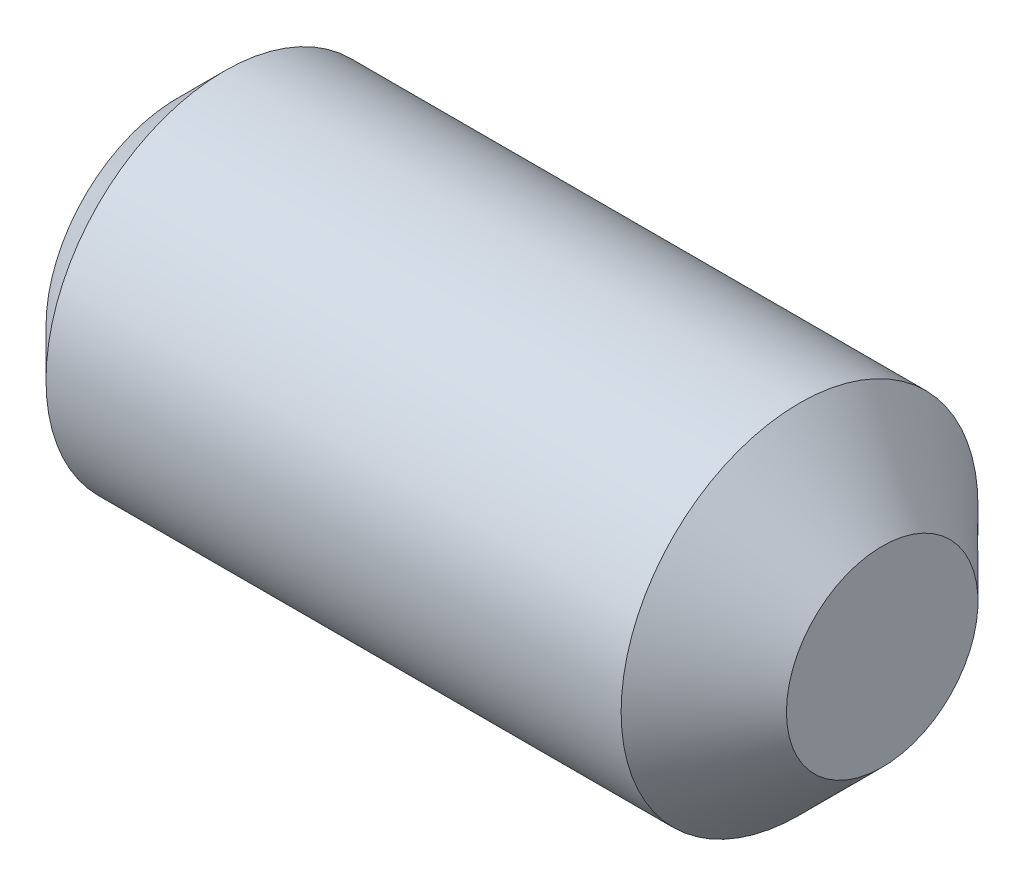
ISO-10303-21;
HEADER;
FILE_DESCRIPTION(('STEP AP214'),'2;1');
FILE_NAME('part.step','',(''),(''),'','','');
FILE_SCHEMA(('AUTOMOTIVE_DESIGN { 1 0 10303 214 1 1 1 1 }'));
ENDSEC;
DATA;
#1=APPLICATION_CONTEXT('core data for automotive mechanical design processes');
#2=APPLICATION_PROTOCOL_DEFINITION('international standard','automotive_design',2000,#1);
#3=PRODUCT_CONTEXT('',#1,'mechanical');
#4=PRODUCT('Part','Part','',(#3));
#5=PRODUCT_RELATED_PRODUCT_CATEGORY('part','',(#4));
#6=PRODUCT_DEFINITION_FORMATION('','',#4);
#7=PRODUCT_DEFINITION_CONTEXT('part definition',#1,'design');
#8=PRODUCT_DEFINITION('design','',#6,#7);
#9=PRODUCT_DEFINITION_SHAPE('','',#8);
#10=(LENGTH_UNIT() NAMED_UNIT(*) SI_UNIT(.MILLI.,.METRE.));
#11=(NAMED_UNIT(*) PLANE_ANGLE_UNIT() SI_UNIT($,.RADIAN.));
#12=(NAMED_UNIT(*) SI_UNIT($,.STERADIAN.) SOLID_ANGLE_UNIT());
#13=UNCERTAINTY_MEASURE_WITH_UNIT(LENGTH_MEASURE(1.E-05),#10,'distance_accuracy_value','');
#14=(GEOMETRIC_REPRESENTATION_CONTEXT(3) GLOBAL_UNCERTAINTY_ASSIGNED_CONTEXT((#13)) GLOBAL_UNIT_ASSIGNED_CONTEXT((#10,
#11,#12)) REPRESENTATION_CONTEXT('',''));
#15=CARTESIAN_POINT('',(0.,0.,0.));
#16=DIRECTION('',(0.,0.,1.));
#17=DIRECTION('',(1.,0.,0.));
#18=AXIS2_PLACEMENT_3D('',#15,#16,#17);
#19=CARTESIAN_POINT('',(0.,0.,0.));
#20=DIRECTION('',(-1.,0.,0.));
#21=DIRECTION('',(0.,0.,1.));
#22=AXIS2_PLACEMENT_3D('',#19,#20,#21);
#23=PLANE('',#22);
#24=CARTESIAN_POINT('',(0.,0.,0.));
#25=DIRECTION('',(-1.,0.,0.));
#26=DIRECTION('',(0.,0.,1.));
#27=AXIS2_PLACEMENT_3D('',#24,#25,#26);
#28=CIRCLE('',#27,1.78308);
#29=CARTESIAN_POINT('',(0.,0.,1.78308));
#30=VERTEX_POINT('',#29);
#31=EDGE_CURVE('E136',#30,#30,#28,.T.);
#32=ORIENTED_EDGE('',*,*,#31,.T.);
#33=EDGE_LOOP('',(#32));
#34=FACE_BOUND('',#33,.T.);
#35=DIRECTION('',(0.,0.,-1.));
#36=VECTOR('',#35,1.);
#37=CARTESIAN_POINT('',(0.,1.18999,0.687041046832968));
#38=LINE('',#37,#36);
#39=CARTESIAN_POINT('',(0.,1.18999,0.687041046832968));
#40=VERTEX_POINT('',#39);
#41=CARTESIAN_POINT('',(0.,1.18999,-0.687041046832959));
#42=VERTEX_POINT('',#41);
#43=EDGE_CURVE('E127',#40,#42,#38,.T.);
#44=ORIENTED_EDGE('',*,*,#43,.F.);
#45=DIRECTION('',(0.,-0.86602540378444,0.499999999999998));
#46=VECTOR('',#45,1.);
#47=CARTESIAN_POINT('',(0.,1.18999,0.687041046832968));
#48=LINE('',#47,#46);
#49=CARTESIAN_POINT('',(0.,0.,1.37408209366593));
#50=VERTEX_POINT('',#49);
#51=EDGE_CURVE('E49',#40,#50,#48,.T.);
#52=ORIENTED_EDGE('',*,*,#51,.T.);
#53=DIRECTION('',(0.,0.866025403784439,0.5));
#54=VECTOR('',#53,1.);
#55=CARTESIAN_POINT('',(0.,-1.18999,0.687041046832965));
#56=LINE('',#55,#54);
#57=CARTESIAN_POINT('',(0.,-1.18999,0.687041046832965));
#58=VERTEX_POINT('',#57);
#59=EDGE_CURVE('E118',#58,#50,#56,.T.);
#60=ORIENTED_EDGE('',*,*,#59,.F.);
#61=DIRECTION('',(0.,0.,-1.));
#62=VECTOR('',#61,1.);
#63=CARTESIAN_POINT('',(0.,-1.18999,0.687041046832965));
#64=LINE('',#63,#62);
#65=CARTESIAN_POINT('',(0.,-1.18999,-0.687041046832961));
#66=VERTEX_POINT('',#65);
#67=EDGE_CURVE('E121',#58,#66,#64,.T.);
#68=ORIENTED_EDGE('',*,*,#67,.T.);
#69=DIRECTION('',(0.,0.86602540378444,-0.499999999999999));
#70=VECTOR('',#69,1.);
#71=CARTESIAN_POINT('',(0.,-1.18999,-0.687041046832961));
#72=LINE('',#71,#70);
#73=CARTESIAN_POINT('',(0.,0.,-1.37408209366592));
#74=VERTEX_POINT('',#73);
#75=EDGE_CURVE('E124',#66,#74,#72,.T.);
#76=ORIENTED_EDGE('',*,*,#75,.T.);
#77=DIRECTION('',(0.,-0.866025403784439,-0.5));
#78=VECTOR('',#77,1.);
#79=CARTESIAN_POINT('',(0.,1.18999,-0.687041046832959));
#80=LINE('',#79,#78);
#81=EDGE_CURVE('E107',#42,#74,#80,.T.);
#82=ORIENTED_EDGE('',*,*,#81,.F.);
#83=EDGE_LOOP('',(#44,#52,#60,#68,#76,#82));
#84=FACE_BOUND('',#83,.T.);
#85=ADVANCED_FACE('F34',(#34,#84),#23,.T.);
#86=CARTESIAN_POINT('',(9.525,1.2954,0.));
#87=DIRECTION('',(1.,0.,0.));
#88=DIRECTION('',(0.,0.,-1.));
#89=AXIS2_PLACEMENT_3D('',#86,#87,#88);
#90=PLANE('',#89);
#91=CARTESIAN_POINT('',(9.525,0.,0.));
#92=DIRECTION('',(-1.,0.,0.));
#93=DIRECTION('',(0.,0.,1.));
#94=AXIS2_PLACEMENT_3D('',#91,#92,#93);
#95=CIRCLE('',#94,1.2954);
#96=CARTESIAN_POINT('',(9.525,0.,1.2954));
#97=VERTEX_POINT('',#96);
#98=EDGE_CURVE('E11',#97,#97,#95,.T.);
#99=ORIENTED_EDGE('',*,*,#98,.F.);
#100=EDGE_LOOP('',(#99));
#101=FACE_BOUND('',#100,.T.);
#102=ADVANCED_FACE('F36',(#101),#90,.T.);
#103=CARTESIAN_POINT('',(8.40740000000001,0.,0.));
#104=DIRECTION('',(-1.,0.,0.));
#105=DIRECTION('',(0.,0.,1.));
#106=AXIS2_PLACEMENT_3D('',#103,#104,#105);
#107=CONICAL_SURFACE('',#106,2.413,0.785398163397453);
#108=ORIENTED_EDGE('',*,*,#98,.T.);
#109=EDGE_LOOP('',(#108));
#110=FACE_BOUND('',#109,.T.);
#111=CARTESIAN_POINT('',(8.40740000000001,0.,0.));
#112=DIRECTION('',(-1.,0.,0.));
#113=DIRECTION('',(0.,0.,1.));
#114=AXIS2_PLACEMENT_3D('',#111,#112,#113);
#115=CIRCLE('',#114,2.413);
#116=CARTESIAN_POINT('',(8.40740000000001,0.,2.413));
#117=VERTEX_POINT('',#116);
#118=EDGE_CURVE('E42',#117,#117,#115,.T.);
#119=ORIENTED_EDGE('',*,*,#118,.F.);
#120=EDGE_LOOP('',(#119));
#121=FACE_BOUND('',#120,.T.);
#122=ADVANCED_FACE('F147',(#110,#121),#107,.T.);
#123=CARTESIAN_POINT('',(-12.7,0.,0.));
#124=DIRECTION('',(-1.,0.,0.));
#125=DIRECTION('',(0.,0.,1.));
#126=AXIS2_PLACEMENT_3D('',#123,#124,#125);
#127=CYLINDRICAL_SURFACE('',#126,2.413);
#128=ORIENTED_EDGE('',*,*,#118,.T.);
#129=EDGE_LOOP('',(#128));
#130=FACE_BOUND('',#129,.T.);
#131=CARTESIAN_POINT('',(0.629920000000003,0.,0.));
#132=DIRECTION('',(-1.,0.,0.));
#133=DIRECTION('',(0.,0.,1.));
#134=AXIS2_PLACEMENT_3D('',#131,#132,#133);
#135=CIRCLE('',#134,2.413);
#136=CARTESIAN_POINT('',(0.629920000000003,0.,2.413));
#137=VERTEX_POINT('',#136);
#138=EDGE_CURVE('E139',#137,#137,#135,.T.);
#139=ORIENTED_EDGE('',*,*,#138,.F.);
#140=EDGE_LOOP('',(#139));
#141=FACE_BOUND('',#140,.T.);
#142=ADVANCED_FACE('F144',(#130,#141),#127,.T.);
#143=CARTESIAN_POINT('',(0.,0.,0.));
#144=DIRECTION('',(1.,0.,0.));
#145=DIRECTION('',(0.,0.,-1.));
#146=AXIS2_PLACEMENT_3D('',#143,#144,#145);
#147=CONICAL_SURFACE('',#146,1.78308,0.785398163397446);
#148=ORIENTED_EDGE('',*,*,#138,.T.);
#149=EDGE_LOOP('',(#148));
#150=FACE_BOUND('',#149,.T.);
#151=ORIENTED_EDGE('',*,*,#31,.F.);
#152=EDGE_LOOP('',(#151));
#153=FACE_BOUND('',#152,.T.);
#154=ADVANCED_FACE('F154',(#150,#153),#147,.T.);
#155=CARTESIAN_POINT('',(2.54,1.18999,0.687041046832968));
#156=DIRECTION('',(0.,-0.499999999999998,-0.86602540378444));
#157=DIRECTION('',(0.,0.86602540378444,-0.499999999999998));
#158=AXIS2_PLACEMENT_3D('',#155,#156,#157);
#159=PLANE('',#158);
#160=ORIENTED_EDGE('',*,*,#51,.F.);
#161=DIRECTION('',(-1.,0.,0.));
#162=VECTOR('',#161,1.);
#163=CARTESIAN_POINT('',(2.54,1.18999,0.687041046832968));
#164=LINE('',#163,#162);
#165=CARTESIAN_POINT('',(2.54,1.18999,0.687041046832968));
#166=VERTEX_POINT('',#165);
#167=EDGE_CURVE('E54',#166,#40,#164,.T.);
#168=ORIENTED_EDGE('',*,*,#167,.F.);
#169=DIRECTION('',(0.,-0.86602540378444,0.499999999999998));
#170=VECTOR('',#169,1.);
#171=CARTESIAN_POINT('',(2.54,1.18999,0.687041046832968));
#172=LINE('',#171,#170);
#173=CARTESIAN_POINT('',(2.54,0.,1.37408209366593));
#174=VERTEX_POINT('',#173);
#175=EDGE_CURVE('E81',#166,#174,#172,.T.);
#176=ORIENTED_EDGE('',*,*,#175,.T.);
#177=DIRECTION('',(-1.,0.,0.));
#178=VECTOR('',#177,1.);
#179=CARTESIAN_POINT('',(2.54,0.,1.37408209366593));
#180=LINE('',#179,#178);
#181=EDGE_CURVE('E134',#174,#50,#180,.T.);
#182=ORIENTED_EDGE('',*,*,#181,.T.);
#183=EDGE_LOOP('',(#160,#168,#176,#182));
#184=FACE_BOUND('',#183,.T.);
#185=ADVANCED_FACE('F165',(#184),#159,.T.);
#186=CARTESIAN_POINT('',(2.54,-1.18999,0.687041046832965));
#187=DIRECTION('',(0.,-0.5,0.866025403784439));
#188=DIRECTION('',(0.,-0.866025403784439,-0.5));
#189=AXIS2_PLACEMENT_3D('',#186,#187,#188);
#190=PLANE('',#189);
#191=ORIENTED_EDGE('',*,*,#59,.T.);
#192=ORIENTED_EDGE('',*,*,#181,.F.);
#193=DIRECTION('',(0.,0.866025403784439,0.5));
#194=VECTOR('',#193,1.);
#195=CARTESIAN_POINT('',(2.54,-1.18999,0.687041046832965));
#196=LINE('',#195,#194);
#197=CARTESIAN_POINT('',(2.54,-1.18999,0.687041046832965));
#198=VERTEX_POINT('',#197);
#199=EDGE_CURVE('E263',#198,#174,#196,.T.);
#200=ORIENTED_EDGE('',*,*,#199,.F.);
#201=DIRECTION('',(-1.,0.,0.));
#202=VECTOR('',#201,1.);
#203=CARTESIAN_POINT('',(2.54,-1.18999,0.687041046832965));
#204=LINE('',#203,#202);
#205=EDGE_CURVE('E132',#198,#58,#204,.T.);
#206=ORIENTED_EDGE('',*,*,#205,.T.);
#207=EDGE_LOOP('',(#191,#192,#200,#206));
#208=FACE_BOUND('',#207,.T.);
#209=ADVANCED_FACE('F172',(#208),#190,.F.);
#210=CARTESIAN_POINT('',(2.54,-1.18999,0.687041046832965));
#211=DIRECTION('',(0.,1.,0.));
#212=DIRECTION('',(0.,0.,1.));
#213=AXIS2_PLACEMENT_3D('',#210,#211,#212);
#214=PLANE('',#213);
#215=ORIENTED_EDGE('',*,*,#67,.F.);
#216=ORIENTED_EDGE('',*,*,#205,.F.);
#217=DIRECTION('',(0.,0.,-1.));
#218=VECTOR('',#217,1.);
#219=CARTESIAN_POINT('',(2.54,-1.18999,0.687041046832965));
#220=LINE('',#219,#218);
#221=CARTESIAN_POINT('',(2.54,-1.18999,-0.687041046832961));
#222=VERTEX_POINT('',#221);
#223=EDGE_CURVE('E102',#198,#222,#220,.T.);
#224=ORIENTED_EDGE('',*,*,#223,.T.);
#225=DIRECTION('',(-1.,0.,0.));
#226=VECTOR('',#225,1.);
#227=CARTESIAN_POINT('',(2.54,-1.18999,-0.687041046832961));
#228=LINE('',#227,#226);
#229=EDGE_CURVE('E97',#222,#66,#228,.T.);
#230=ORIENTED_EDGE('',*,*,#229,.T.);
#231=EDGE_LOOP('',(#215,#216,#224,#230));
#232=FACE_BOUND('',#231,.T.);
#233=ADVANCED_FACE('F179',(#232),#214,.T.);
#234=CARTESIAN_POINT('',(2.54,-1.18999,-0.687041046832961));
#235=DIRECTION('',(0.,0.499999999999998,0.866025403784439));
#236=DIRECTION('',(0.,-0.86602540378444,0.499999999999999));
#237=AXIS2_PLACEMENT_3D('',#234,#235,#236);
#238=PLANE('',#237);
#239=ORIENTED_EDGE('',*,*,#75,.F.);
#240=ORIENTED_EDGE('',*,*,#229,.F.);
#241=DIRECTION('',(0.,0.86602540378444,-0.499999999999999));
#242=VECTOR('',#241,1.);
#243=CARTESIAN_POINT('',(2.54,-1.18999,-0.687041046832961));
#244=LINE('',#243,#242);
#245=CARTESIAN_POINT('',(2.54,0.,-1.37408209366592));
#246=VERTEX_POINT('',#245);
#247=EDGE_CURVE('E92',#222,#246,#244,.T.);
#248=ORIENTED_EDGE('',*,*,#247,.T.);
#249=DIRECTION('',(-1.,0.,0.));
#250=VECTOR('',#249,1.);
#251=CARTESIAN_POINT('',(2.54,0.,-1.37408209366592));
#252=LINE('',#251,#250);
#253=EDGE_CURVE('E96',#246,#74,#252,.T.);
#254=ORIENTED_EDGE('',*,*,#253,.T.);
#255=EDGE_LOOP('',(#239,#240,#248,#254));
#256=FACE_BOUND('',#255,.T.);
#257=ADVANCED_FACE('F95',(#256),#238,.T.);
#258=CARTESIAN_POINT('',(2.54,1.18999,-0.687041046832959));
#259=DIRECTION('',(0.,0.5,-0.866025403784439));
#260=DIRECTION('',(0.,0.866025403784439,0.5));
#261=AXIS2_PLACEMENT_3D('',#258,#259,#260);
#262=PLANE('',#261);
#263=ORIENTED_EDGE('',*,*,#81,.T.);
#264=ORIENTED_EDGE('',*,*,#253,.F.);
#265=DIRECTION('',(0.,-0.866025403784439,-0.5));
#266=VECTOR('',#265,1.);
#267=CARTESIAN_POINT('',(2.54,1.18999,-0.687041046832959));
#268=LINE('',#267,#266);
#269=CARTESIAN_POINT('',(2.54,1.18999,-0.687041046832959));
#270=VERTEX_POINT('',#269);
#271=EDGE_CURVE('E101',#270,#246,#268,.T.);
#272=ORIENTED_EDGE('',*,*,#271,.F.);
#273=DIRECTION('',(-1.,0.,0.));
#274=VECTOR('',#273,1.);
#275=CARTESIAN_POINT('',(2.54,1.18999,-0.687041046832959));
#276=LINE('',#275,#274);
#277=EDGE_CURVE('E77',#270,#42,#276,.T.);
#278=ORIENTED_EDGE('',*,*,#277,.T.);
#279=EDGE_LOOP('',(#263,#264,#272,#278));
#280=FACE_BOUND('',#279,.T.);
#281=ADVANCED_FACE('F104',(#280),#262,.F.);
#282=CARTESIAN_POINT('',(2.54,1.18999,0.687041046832968));
#283=DIRECTION('',(0.,1.,0.));
#284=DIRECTION('',(0.,0.,1.));
#285=AXIS2_PLACEMENT_3D('',#282,#283,#284);
#286=PLANE('',#285);
#287=ORIENTED_EDGE('',*,*,#43,.T.);
#288=ORIENTED_EDGE('',*,*,#277,.F.);
#289=DIRECTION('',(0.,0.,-1.));
#290=VECTOR('',#289,1.);
#291=CARTESIAN_POINT('',(2.54,1.18999,0.687041046832968));
#292=LINE('',#291,#290);
#293=EDGE_CURVE('E112',#166,#270,#292,.T.);
#294=ORIENTED_EDGE('',*,*,#293,.F.);
#295=ORIENTED_EDGE('',*,*,#167,.T.);
#296=EDGE_LOOP('',(#287,#288,#294,#295));
#297=FACE_BOUND('',#296,.T.);
#298=ADVANCED_FACE('F191',(#297),#286,.F.);
#299=CARTESIAN_POINT('',(2.54,1.18999,0.687041046832968));
#300=DIRECTION('',(1.,0.,0.));
#301=DIRECTION('',(0.,0.,-1.));
#302=AXIS2_PLACEMENT_3D('',#299,#300,#301);
#303=PLANE('',#302);
#304=ORIENTED_EDGE('',*,*,#175,.F.);
#305=ORIENTED_EDGE('',*,*,#293,.T.);
#306=ORIENTED_EDGE('',*,*,#271,.T.);
#307=ORIENTED_EDGE('',*,*,#247,.F.);
#308=ORIENTED_EDGE('',*,*,#223,.F.);
#309=ORIENTED_EDGE('',*,*,#199,.T.);
#310=EDGE_LOOP('',(#304,#305,#306,#307,#308,#309));
#311=FACE_BOUND('',#310,.T.);
#312=ADVANCED_FACE('F110',(#311),#303,.F.);
#313=CLOSED_SHELL('',(#85,#102,#122,#142,#154,#185,#209,#233,#257,#281,#298,#312));
#314=MANIFOLD_SOLID_BREP('B2',#313);
#315=ADVANCED_BREP_SHAPE_REPRESENTATION('',(#18,#314),#14);
#316=SHAPE_DEFINITION_REPRESENTATION(#9,#315);
ENDSEC;
END-ISO-10303-21;
